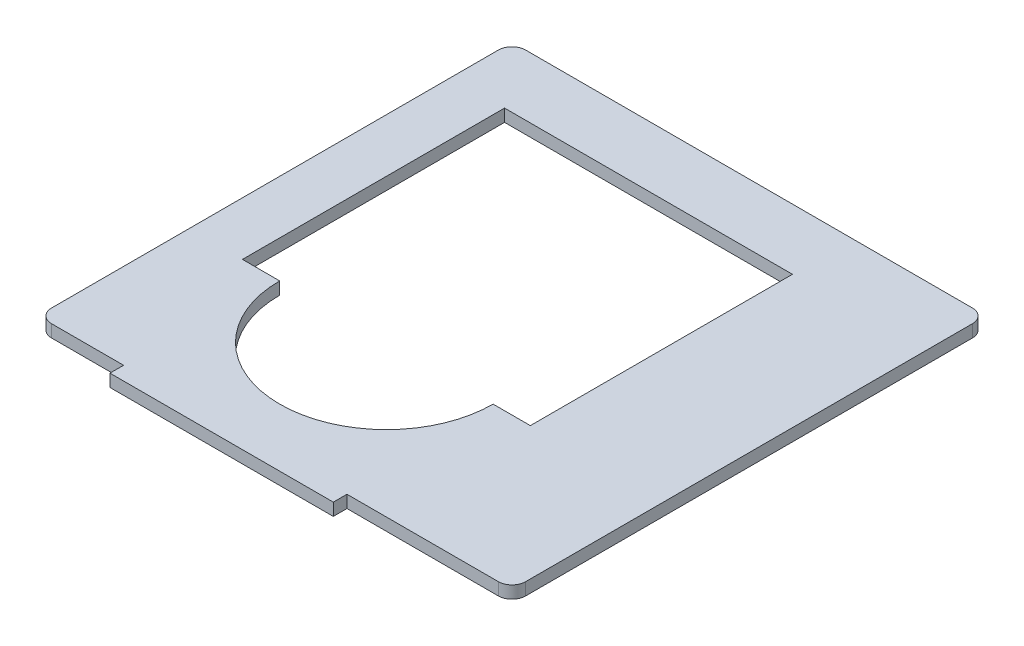
ISO-10303-21;
HEADER;
FILE_DESCRIPTION(('STEP AP214'),'2;1');
FILE_NAME('part.step','',(''),(''),'','','');
FILE_SCHEMA(('AUTOMOTIVE_DESIGN { 1 0 10303 214 1 1 1 1 }'));
ENDSEC;
DATA;
#1=APPLICATION_CONTEXT('core data for automotive mechanical design processes');
#2=APPLICATION_PROTOCOL_DEFINITION('international standard','automotive_design',2000,#1);
#3=PRODUCT_CONTEXT('',#1,'mechanical');
#4=PRODUCT('Part','Part','',(#3));
#5=PRODUCT_RELATED_PRODUCT_CATEGORY('part','',(#4));
#6=PRODUCT_DEFINITION_FORMATION('','',#4);
#7=PRODUCT_DEFINITION_CONTEXT('part definition',#1,'design');
#8=PRODUCT_DEFINITION('design','',#6,#7);
#9=PRODUCT_DEFINITION_SHAPE('','',#8);
#10=(LENGTH_UNIT() NAMED_UNIT(*) SI_UNIT(.MILLI.,.METRE.));
#11=(NAMED_UNIT(*) PLANE_ANGLE_UNIT() SI_UNIT($,.RADIAN.));
#12=(NAMED_UNIT(*) SI_UNIT($,.STERADIAN.) SOLID_ANGLE_UNIT());
#13=UNCERTAINTY_MEASURE_WITH_UNIT(LENGTH_MEASURE(1.E-05),#10,'distance_accuracy_value','');
#14=(GEOMETRIC_REPRESENTATION_CONTEXT(3) GLOBAL_UNCERTAINTY_ASSIGNED_CONTEXT((#13)) GLOBAL_UNIT_ASSIGNED_CONTEXT((#10,
#11,#12)) REPRESENTATION_CONTEXT('',''));
#15=CARTESIAN_POINT('',(0.,0.,0.));
#16=DIRECTION('',(0.,0.,1.));
#17=DIRECTION('',(1.,0.,0.));
#18=AXIS2_PLACEMENT_3D('',#15,#16,#17);
#19=CARTESIAN_POINT('',(90.,2.5,95.4999999999999));
#20=DIRECTION('',(0.,0.,-1.));
#21=DIRECTION('',(-1.,0.,0.));
#22=AXIS2_PLACEMENT_3D('',#19,#20,#21);
#23=PLANE('',#22);
#24=DIRECTION('',(1.,0.,0.));
#25=VECTOR('',#24,1.);
#26=CARTESIAN_POINT('',(90.,-2.5,95.4999999999999));
#27=LINE('',#26,#25);
#28=CARTESIAN_POINT('',(-90.,-2.5,95.5));
#29=VERTEX_POINT('',#28);
#30=CARTESIAN_POINT('',(-61.,-2.5,95.5));
#31=VERTEX_POINT('',#30);
#32=EDGE_CURVE('E271',#29,#31,#27,.T.);
#33=ORIENTED_EDGE('',*,*,#32,.T.);
#34=DIRECTION('',(0.,1.,0.));
#35=VECTOR('',#34,1.);
#36=CARTESIAN_POINT('',(-61.0000000000001,-2.5,95.5));
#37=LINE('',#36,#35);
#38=CARTESIAN_POINT('',(-61.,2.5,95.5));
#39=VERTEX_POINT('',#38);
#40=EDGE_CURVE('E61',#31,#39,#37,.T.);
#41=ORIENTED_EDGE('',*,*,#40,.T.);
#42=DIRECTION('',(1.,0.,0.));
#43=VECTOR('',#42,1.);
#44=CARTESIAN_POINT('',(90.,2.5,95.4999999999999));
#45=LINE('',#44,#43);
#46=CARTESIAN_POINT('',(-90.,2.5,95.5));
#47=VERTEX_POINT('',#46);
#48=EDGE_CURVE('E289',#47,#39,#45,.T.);
#49=ORIENTED_EDGE('',*,*,#48,.F.);
#50=DIRECTION('',(0.,-1.,0.));
#51=VECTOR('',#50,1.);
#52=CARTESIAN_POINT('',(-90.,2.5,95.5));
#53=LINE('',#52,#51);
#54=EDGE_CURVE('E320',#47,#29,#53,.T.);
#55=ORIENTED_EDGE('',*,*,#54,.T.);
#56=EDGE_LOOP('',(#33,#41,#49,#55));
#57=FACE_BOUND('',#56,.T.);
#58=ADVANCED_FACE('F37',(#57),#23,.F.);
#59=CARTESIAN_POINT('',(90.,2.5,89.9999999999999));
#60=DIRECTION('',(0.,-1.,0.));
#61=DIRECTION('',(0.,0.,-1.));
#62=AXIS2_PLACEMENT_3D('',#59,#60,#61);
#63=CYLINDRICAL_SURFACE('',#62,5.5);
#64=CARTESIAN_POINT('',(90.,-2.5,89.9999999999999));
#65=DIRECTION('',(0.,1.,0.));
#66=DIRECTION('',(0.,0.,-1.));
#67=AXIS2_PLACEMENT_3D('',#64,#65,#66);
#68=CIRCLE('',#67,5.5);
#69=CARTESIAN_POINT('',(90.,-2.5,95.4999999999999));
#70=VERTEX_POINT('',#69);
#71=CARTESIAN_POINT('',(95.5,-2.5,89.9999999999999));
#72=VERTEX_POINT('',#71);
#73=EDGE_CURVE('E250',#70,#72,#68,.T.);
#74=ORIENTED_EDGE('',*,*,#73,.T.);
#75=DIRECTION('',(0.,-1.,0.));
#76=VECTOR('',#75,1.);
#77=CARTESIAN_POINT('',(95.5,2.5,89.9999999999999));
#78=LINE('',#77,#76);
#79=CARTESIAN_POINT('',(95.5,2.5,89.9999999999999));
#80=VERTEX_POINT('',#79);
#81=EDGE_CURVE('E11',#80,#72,#78,.T.);
#82=ORIENTED_EDGE('',*,*,#81,.F.);
#83=CARTESIAN_POINT('',(90.,2.5,89.9999999999999));
#84=DIRECTION('',(0.,1.,0.));
#85=DIRECTION('',(0.,0.,-1.));
#86=AXIS2_PLACEMENT_3D('',#83,#84,#85);
#87=CIRCLE('',#86,5.5);
#88=CARTESIAN_POINT('',(90.,2.5,95.4999999999999));
#89=VERTEX_POINT('',#88);
#90=EDGE_CURVE('E266',#89,#80,#87,.T.);
#91=ORIENTED_EDGE('',*,*,#90,.F.);
#92=DIRECTION('',(0.,-1.,0.));
#93=VECTOR('',#92,1.);
#94=CARTESIAN_POINT('',(90.,2.5,95.4999999999999));
#95=LINE('',#94,#93);
#96=EDGE_CURVE('E292',#89,#70,#95,.T.);
#97=ORIENTED_EDGE('',*,*,#96,.T.);
#98=EDGE_LOOP('',(#74,#82,#91,#97));
#99=FACE_BOUND('',#98,.T.);
#100=ADVANCED_FACE('F39',(#99),#63,.T.);
#101=CARTESIAN_POINT('',(95.5,2.5,-90.0000000000001));
#102=DIRECTION('',(-1.,0.,0.));
#103=DIRECTION('',(0.,0.,1.));
#104=AXIS2_PLACEMENT_3D('',#101,#102,#103);
#105=PLANE('',#104);
#106=DIRECTION('',(0.,0.,-1.));
#107=VECTOR('',#106,1.);
#108=CARTESIAN_POINT('',(95.5,-2.5,-90.0000000000001));
#109=LINE('',#108,#107);
#110=CARTESIAN_POINT('',(95.5,-2.5,-90.0000000000001));
#111=VERTEX_POINT('',#110);
#112=EDGE_CURVE('E296',#72,#111,#109,.T.);
#113=ORIENTED_EDGE('',*,*,#112,.T.);
#114=DIRECTION('',(0.,-1.,0.));
#115=VECTOR('',#114,1.);
#116=CARTESIAN_POINT('',(95.5,2.5,-90.0000000000001));
#117=LINE('',#116,#115);
#118=CARTESIAN_POINT('',(95.5,2.5,-90.0000000000001));
#119=VERTEX_POINT('',#118);
#120=EDGE_CURVE('E46',#119,#111,#117,.T.);
#121=ORIENTED_EDGE('',*,*,#120,.F.);
#122=DIRECTION('',(0.,0.,-1.));
#123=VECTOR('',#122,1.);
#124=CARTESIAN_POINT('',(95.5,2.5,-90.0000000000001));
#125=LINE('',#124,#123);
#126=EDGE_CURVE('E270',#80,#119,#125,.T.);
#127=ORIENTED_EDGE('',*,*,#126,.F.);
#128=ORIENTED_EDGE('',*,*,#81,.T.);
#129=EDGE_LOOP('',(#113,#121,#127,#128));
#130=FACE_BOUND('',#129,.T.);
#131=ADVANCED_FACE('F365',(#130),#105,.F.);
#132=CARTESIAN_POINT('',(90.,2.5,-90.0000000000001));
#133=DIRECTION('',(0.,-1.,0.));
#134=DIRECTION('',(0.,0.,-1.));
#135=AXIS2_PLACEMENT_3D('',#132,#133,#134);
#136=CYLINDRICAL_SURFACE('',#135,5.50000000000002);
#137=CARTESIAN_POINT('',(90.,-2.5,-90.0000000000001));
#138=DIRECTION('',(0.,1.,0.));
#139=DIRECTION('',(0.,0.,-1.));
#140=AXIS2_PLACEMENT_3D('',#137,#138,#139);
#141=CIRCLE('',#140,5.50000000000002);
#142=CARTESIAN_POINT('',(90.,-2.5,-95.5000000000001));
#143=VERTEX_POINT('',#142);
#144=EDGE_CURVE('E299',#111,#143,#141,.T.);
#145=ORIENTED_EDGE('',*,*,#144,.T.);
#146=DIRECTION('',(0.,-1.,0.));
#147=VECTOR('',#146,1.);
#148=CARTESIAN_POINT('',(90.,2.5,-95.5000000000001));
#149=LINE('',#148,#147);
#150=CARTESIAN_POINT('',(90.,2.5,-95.5000000000001));
#151=VERTEX_POINT('',#150);
#152=EDGE_CURVE('E336',#151,#143,#149,.T.);
#153=ORIENTED_EDGE('',*,*,#152,.F.);
#154=CARTESIAN_POINT('',(90.,2.5,-90.0000000000001));
#155=DIRECTION('',(0.,1.,0.));
#156=DIRECTION('',(0.,0.,-1.));
#157=AXIS2_PLACEMENT_3D('',#154,#155,#156);
#158=CIRCLE('',#157,5.50000000000002);
#159=EDGE_CURVE('E274',#119,#151,#158,.T.);
#160=ORIENTED_EDGE('',*,*,#159,.F.);
#161=ORIENTED_EDGE('',*,*,#120,.T.);
#162=EDGE_LOOP('',(#145,#153,#160,#161));
#163=FACE_BOUND('',#162,.T.);
#164=ADVANCED_FACE('F345',(#163),#136,.T.);
#165=CARTESIAN_POINT('',(90.,2.5,-95.5000000000001));
#166=DIRECTION('',(0.,0.,1.));
#167=DIRECTION('',(1.,0.,0.));
#168=AXIS2_PLACEMENT_3D('',#165,#166,#167);
#169=PLANE('',#168);
#170=DIRECTION('',(-1.,0.,0.));
#171=VECTOR('',#170,1.);
#172=CARTESIAN_POINT('',(90.,-2.5,-95.5000000000001));
#173=LINE('',#172,#171);
#174=CARTESIAN_POINT('',(-90.,-2.5,-95.5));
#175=VERTEX_POINT('',#174);
#176=EDGE_CURVE('E302',#143,#175,#173,.T.);
#177=ORIENTED_EDGE('',*,*,#176,.T.);
#178=DIRECTION('',(0.,-1.,0.));
#179=VECTOR('',#178,1.);
#180=CARTESIAN_POINT('',(-90.,2.5,-95.5));
#181=LINE('',#180,#179);
#182=CARTESIAN_POINT('',(-90.,2.5,-95.5));
#183=VERTEX_POINT('',#182);
#184=EDGE_CURVE('E332',#183,#175,#181,.T.);
#185=ORIENTED_EDGE('',*,*,#184,.F.);
#186=DIRECTION('',(-1.,0.,0.));
#187=VECTOR('',#186,1.);
#188=CARTESIAN_POINT('',(90.,2.5,-95.5000000000001));
#189=LINE('',#188,#187);
#190=EDGE_CURVE('E277',#151,#183,#189,.T.);
#191=ORIENTED_EDGE('',*,*,#190,.F.);
#192=ORIENTED_EDGE('',*,*,#152,.T.);
#193=EDGE_LOOP('',(#177,#185,#191,#192));
#194=FACE_BOUND('',#193,.T.);
#195=ADVANCED_FACE('F353',(#194),#169,.F.);
#196=CARTESIAN_POINT('',(-90.,2.5,-90.));
#197=DIRECTION('',(0.,-1.,0.));
#198=DIRECTION('',(0.,0.,-1.));
#199=AXIS2_PLACEMENT_3D('',#196,#197,#198);
#200=CYLINDRICAL_SURFACE('',#199,5.5);
#201=CARTESIAN_POINT('',(-90.,-2.5,-90.));
#202=DIRECTION('',(0.,1.,0.));
#203=DIRECTION('',(0.,0.,1.));
#204=AXIS2_PLACEMENT_3D('',#201,#202,#203);
#205=CIRCLE('',#204,5.5);
#206=CARTESIAN_POINT('',(-95.5,-2.5,-90.));
#207=VERTEX_POINT('',#206);
#208=EDGE_CURVE('E305',#175,#207,#205,.T.);
#209=ORIENTED_EDGE('',*,*,#208,.T.);
#210=DIRECTION('',(0.,-1.,0.));
#211=VECTOR('',#210,1.);
#212=CARTESIAN_POINT('',(-95.5,2.5,-90.));
#213=LINE('',#212,#211);
#214=CARTESIAN_POINT('',(-95.5,2.5,-90.));
#215=VERTEX_POINT('',#214);
#216=EDGE_CURVE('E328',#215,#207,#213,.T.);
#217=ORIENTED_EDGE('',*,*,#216,.F.);
#218=CARTESIAN_POINT('',(-90.,2.5,-90.));
#219=DIRECTION('',(0.,1.,0.));
#220=DIRECTION('',(0.,0.,1.));
#221=AXIS2_PLACEMENT_3D('',#218,#219,#220);
#222=CIRCLE('',#221,5.5);
#223=EDGE_CURVE('E280',#183,#215,#222,.T.);
#224=ORIENTED_EDGE('',*,*,#223,.F.);
#225=ORIENTED_EDGE('',*,*,#184,.T.);
#226=EDGE_LOOP('',(#209,#217,#224,#225));
#227=FACE_BOUND('',#226,.T.);
#228=ADVANCED_FACE('F357',(#227),#200,.T.);
#229=CARTESIAN_POINT('',(-95.5,2.5,-90.));
#230=DIRECTION('',(1.,0.,0.));
#231=DIRECTION('',(0.,0.,-1.));
#232=AXIS2_PLACEMENT_3D('',#229,#230,#231);
#233=PLANE('',#232);
#234=DIRECTION('',(0.,0.,1.));
#235=VECTOR('',#234,1.);
#236=CARTESIAN_POINT('',(-95.5,-2.5,-90.));
#237=LINE('',#236,#235);
#238=CARTESIAN_POINT('',(-95.5,-2.5,90.));
#239=VERTEX_POINT('',#238);
#240=EDGE_CURVE('E308',#207,#239,#237,.T.);
#241=ORIENTED_EDGE('',*,*,#240,.T.);
#242=DIRECTION('',(0.,-1.,0.));
#243=VECTOR('',#242,1.);
#244=CARTESIAN_POINT('',(-95.5,2.5,90.));
#245=LINE('',#244,#243);
#246=CARTESIAN_POINT('',(-95.5,2.5,90.));
#247=VERTEX_POINT('',#246);
#248=EDGE_CURVE('E324',#247,#239,#245,.T.);
#249=ORIENTED_EDGE('',*,*,#248,.F.);
#250=DIRECTION('',(0.,0.,1.));
#251=VECTOR('',#250,1.);
#252=CARTESIAN_POINT('',(-95.5,2.5,-90.));
#253=LINE('',#252,#251);
#254=EDGE_CURVE('E283',#215,#247,#253,.T.);
#255=ORIENTED_EDGE('',*,*,#254,.F.);
#256=ORIENTED_EDGE('',*,*,#216,.T.);
#257=EDGE_LOOP('',(#241,#249,#255,#256));
#258=FACE_BOUND('',#257,.T.);
#259=ADVANCED_FACE('F378',(#258),#233,.F.);
#260=CARTESIAN_POINT('',(-90.,2.5,90.));
#261=DIRECTION('',(0.,-1.,0.));
#262=DIRECTION('',(0.,0.,-1.));
#263=AXIS2_PLACEMENT_3D('',#260,#261,#262);
#264=CYLINDRICAL_SURFACE('',#263,5.5);
#265=CARTESIAN_POINT('',(-90.,-2.5,90.));
#266=DIRECTION('',(0.,1.,0.));
#267=DIRECTION('',(0.,0.,-1.));
#268=AXIS2_PLACEMENT_3D('',#265,#266,#267);
#269=CIRCLE('',#268,5.5);
#270=EDGE_CURVE('E311',#239,#29,#269,.T.);
#271=ORIENTED_EDGE('',*,*,#270,.T.);
#272=ORIENTED_EDGE('',*,*,#54,.F.);
#273=CARTESIAN_POINT('',(-90.,2.5,90.));
#274=DIRECTION('',(0.,1.,0.));
#275=DIRECTION('',(0.,0.,-1.));
#276=AXIS2_PLACEMENT_3D('',#273,#274,#275);
#277=CIRCLE('',#276,5.5);
#278=EDGE_CURVE('E286',#247,#47,#277,.T.);
#279=ORIENTED_EDGE('',*,*,#278,.F.);
#280=ORIENTED_EDGE('',*,*,#248,.T.);
#281=EDGE_LOOP('',(#271,#272,#279,#280));
#282=FACE_BOUND('',#281,.T.);
#283=ADVANCED_FACE('F376',(#282),#264,.T.);
#284=CARTESIAN_POINT('',(28.9999999999999,2.5,95.5));
#285=VERTEX_POINT('',#284);
#286=EDGE_CURVE('E53',#285,#89,#45,.T.);
#287=ORIENTED_EDGE('',*,*,#286,.F.);
#288=DIRECTION('',(0.,1.,0.));
#289=VECTOR('',#288,1.);
#290=CARTESIAN_POINT('',(28.9999999999999,-2.5,95.5));
#291=LINE('',#290,#289);
#292=CARTESIAN_POINT('',(28.9999999999999,-2.5,95.5));
#293=VERTEX_POINT('',#292);
#294=EDGE_CURVE('E199',#293,#285,#291,.T.);
#295=ORIENTED_EDGE('',*,*,#294,.F.);
#296=EDGE_CURVE('E314',#293,#70,#27,.T.);
#297=ORIENTED_EDGE('',*,*,#296,.T.);
#298=ORIENTED_EDGE('',*,*,#96,.F.);
#299=EDGE_LOOP('',(#287,#295,#297,#298));
#300=FACE_BOUND('',#299,.T.);
#301=ADVANCED_FACE('F368',(#300),#23,.F.);
#302=CARTESIAN_POINT('',(90.,2.5,89.9999999999999));
#303=DIRECTION('',(0.,-1.,0.));
#304=DIRECTION('',(0.,0.,-1.));
#305=AXIS2_PLACEMENT_3D('',#302,#303,#304);
#306=PLANE('',#305);
#307=DIRECTION('',(0.,0.,1.));
#308=VECTOR('',#307,1.);
#309=CARTESIAN_POINT('',(-74.0000000000026,2.5,-70.999999999998));
#310=LINE('',#309,#308);
#311=CARTESIAN_POINT('',(-74.0000000000025,2.5,-70.999999999998));
#312=VERTEX_POINT('',#311);
#313=CARTESIAN_POINT('',(-74.0000000000025,2.5,34.6102296711069));
#314=VERTEX_POINT('',#313);
#315=EDGE_CURVE('E228',#312,#314,#310,.T.);
#316=ORIENTED_EDGE('',*,*,#315,.F.);
#317=DIRECTION('',(-1.,0.,0.));
#318=VECTOR('',#317,1.);
#319=CARTESIAN_POINT('',(41.9999999999974,2.5,-70.999999999998));
#320=LINE('',#319,#318);
#321=CARTESIAN_POINT('',(41.9999999999974,2.5,-70.999999999998));
#322=VERTEX_POINT('',#321);
#323=EDGE_CURVE('E198',#322,#312,#320,.T.);
#324=ORIENTED_EDGE('',*,*,#323,.F.);
#325=DIRECTION('',(0.,0.,1.));
#326=VECTOR('',#325,1.);
#327=CARTESIAN_POINT('',(41.9999999999974,2.5,-70.999999999998));
#328=LINE('',#327,#326);
#329=CARTESIAN_POINT('',(41.9999999999974,2.5,34.6102296711068));
#330=VERTEX_POINT('',#329);
#331=EDGE_CURVE('E207',#322,#330,#328,.T.);
#332=ORIENTED_EDGE('',*,*,#331,.T.);
#333=DIRECTION('',(1.,0.,0.));
#334=VECTOR('',#333,1.);
#335=CARTESIAN_POINT('',(26.9999999999974,2.5,34.6102296711068));
#336=LINE('',#335,#334);
#337=CARTESIAN_POINT('',(26.9999999999974,2.5,34.6102296711068));
#338=VERTEX_POINT('',#337);
#339=EDGE_CURVE('E240',#338,#330,#336,.T.);
#340=ORIENTED_EDGE('',*,*,#339,.F.);
#341=CARTESIAN_POINT('',(-16.0000000000026,2.5,34.6102296711069));
#342=DIRECTION('',(0.,-1.,0.));
#343=DIRECTION('',(0.,0.,-1.));
#344=AXIS2_PLACEMENT_3D('',#341,#342,#343);
#345=CIRCLE('',#344,43.);
#346=CARTESIAN_POINT('',(-59.0000000000026,2.5,34.6102296711069));
#347=VERTEX_POINT('',#346);
#348=EDGE_CURVE('E236',#338,#347,#345,.T.);
#349=ORIENTED_EDGE('',*,*,#348,.T.);
#350=DIRECTION('',(-1.,0.,0.));
#351=VECTOR('',#350,1.);
#352=CARTESIAN_POINT('',(-59.0000000000026,2.5,34.6102296711069));
#353=LINE('',#352,#351);
#354=EDGE_CURVE('E232',#347,#314,#353,.T.);
#355=ORIENTED_EDGE('',*,*,#354,.T.);
#356=EDGE_LOOP('',(#316,#324,#332,#340,#349,#355));
#357=FACE_BOUND('',#356,.T.);
#358=ORIENTED_EDGE('',*,*,#90,.T.);
#359=ORIENTED_EDGE('',*,*,#126,.T.);
#360=ORIENTED_EDGE('',*,*,#159,.T.);
#361=ORIENTED_EDGE('',*,*,#190,.T.);
#362=ORIENTED_EDGE('',*,*,#223,.T.);
#363=ORIENTED_EDGE('',*,*,#254,.T.);
#364=ORIENTED_EDGE('',*,*,#278,.T.);
#365=ORIENTED_EDGE('',*,*,#48,.T.);
#366=DIRECTION('',(0.,0.,1.));
#367=VECTOR('',#366,1.);
#368=CARTESIAN_POINT('',(-61.0000000000001,2.5,101.000000000002));
#369=LINE('',#368,#367);
#370=CARTESIAN_POINT('',(-61.0000000000001,2.5,101.000000000002));
#371=VERTEX_POINT('',#370);
#372=EDGE_CURVE('E194',#39,#371,#369,.T.);
#373=ORIENTED_EDGE('',*,*,#372,.T.);
#374=DIRECTION('',(1.,0.,0.));
#375=VECTOR('',#374,1.);
#376=CARTESIAN_POINT('',(-61.0000000000001,2.5,101.000000000002));
#377=LINE('',#376,#375);
#378=CARTESIAN_POINT('',(28.9999999999999,2.5,101.000000000002));
#379=VERTEX_POINT('',#378);
#380=EDGE_CURVE('E170',#371,#379,#377,.T.);
#381=ORIENTED_EDGE('',*,*,#380,.T.);
#382=DIRECTION('',(0.,0.,-1.));
#383=VECTOR('',#382,1.);
#384=CARTESIAN_POINT('',(28.9999999999999,2.5,101.000000000002));
#385=LINE('',#384,#383);
#386=EDGE_CURVE('E188',#379,#285,#385,.T.);
#387=ORIENTED_EDGE('',*,*,#386,.T.);
#388=ORIENTED_EDGE('',*,*,#286,.T.);
#389=EDGE_LOOP('',(#358,#359,#360,#361,#362,#363,#364,#365,#373,#381,#387,#388));
#390=FACE_BOUND('',#389,.T.);
#391=ADVANCED_FACE('F361',(#357,#390),#306,.F.);
#392=CARTESIAN_POINT('',(90.,-2.5,89.9999999999999));
#393=DIRECTION('',(0.,-1.,0.));
#394=DIRECTION('',(0.,0.,-1.));
#395=AXIS2_PLACEMENT_3D('',#392,#393,#394);
#396=PLANE('',#395);
#397=DIRECTION('',(-1.,0.,0.));
#398=VECTOR('',#397,1.);
#399=CARTESIAN_POINT('',(41.9999999999974,-2.5,-70.999999999998));
#400=LINE('',#399,#398);
#401=CARTESIAN_POINT('',(41.9999999999974,-2.5,-70.999999999998));
#402=VERTEX_POINT('',#401);
#403=CARTESIAN_POINT('',(-74.0000000000026,-2.5,-70.999999999998));
#404=VERTEX_POINT('',#403);
#405=EDGE_CURVE('E202',#402,#404,#400,.T.);
#406=ORIENTED_EDGE('',*,*,#405,.T.);
#407=DIRECTION('',(0.,0.,1.));
#408=VECTOR('',#407,1.);
#409=CARTESIAN_POINT('',(-74.0000000000026,-2.5,-70.999999999998));
#410=LINE('',#409,#408);
#411=CARTESIAN_POINT('',(-74.0000000000025,-2.5,34.6102296711069));
#412=VERTEX_POINT('',#411);
#413=EDGE_CURVE('E206',#404,#412,#410,.T.);
#414=ORIENTED_EDGE('',*,*,#413,.T.);
#415=DIRECTION('',(-1.,0.,0.));
#416=VECTOR('',#415,1.);
#417=CARTESIAN_POINT('',(-59.0000000000026,-2.5,34.6102296711069));
#418=LINE('',#417,#416);
#419=CARTESIAN_POINT('',(-59.0000000000026,-2.5,34.6102296711069));
#420=VERTEX_POINT('',#419);
#421=EDGE_CURVE('E211',#420,#412,#418,.T.);
#422=ORIENTED_EDGE('',*,*,#421,.F.);
#423=CARTESIAN_POINT('',(-16.0000000000026,-2.5,34.6102296711069));
#424=DIRECTION('',(0.,-1.,0.));
#425=DIRECTION('',(0.,0.,-1.));
#426=AXIS2_PLACEMENT_3D('',#423,#424,#425);
#427=CIRCLE('',#426,43.);
#428=CARTESIAN_POINT('',(26.9999999999974,-2.5,34.6102296711068));
#429=VERTEX_POINT('',#428);
#430=EDGE_CURVE('E215',#429,#420,#427,.T.);
#431=ORIENTED_EDGE('',*,*,#430,.F.);
#432=DIRECTION('',(1.,0.,0.));
#433=VECTOR('',#432,1.);
#434=CARTESIAN_POINT('',(26.9999999999974,-2.5,34.6102296711068));
#435=LINE('',#434,#433);
#436=CARTESIAN_POINT('',(41.9999999999974,-2.5,34.6102296711068));
#437=VERTEX_POINT('',#436);
#438=EDGE_CURVE('E218',#429,#437,#435,.T.);
#439=ORIENTED_EDGE('',*,*,#438,.T.);
#440=DIRECTION('',(0.,0.,1.));
#441=VECTOR('',#440,1.);
#442=CARTESIAN_POINT('',(41.9999999999974,-2.5,-70.999999999998));
#443=LINE('',#442,#441);
#444=EDGE_CURVE('E222',#402,#437,#443,.T.);
#445=ORIENTED_EDGE('',*,*,#444,.F.);
#446=EDGE_LOOP('',(#406,#414,#422,#431,#439,#445));
#447=FACE_BOUND('',#446,.T.);
#448=ORIENTED_EDGE('',*,*,#73,.F.);
#449=ORIENTED_EDGE('',*,*,#296,.F.);
#450=DIRECTION('',(0.,0.,-1.));
#451=VECTOR('',#450,1.);
#452=CARTESIAN_POINT('',(28.9999999999999,-2.5,101.000000000002));
#453=LINE('',#452,#451);
#454=CARTESIAN_POINT('',(28.9999999999999,-2.5,101.000000000002));
#455=VERTEX_POINT('',#454);
#456=EDGE_CURVE('E176',#455,#293,#453,.T.);
#457=ORIENTED_EDGE('',*,*,#456,.F.);
#458=DIRECTION('',(1.,0.,0.));
#459=VECTOR('',#458,1.);
#460=CARTESIAN_POINT('',(-61.0000000000001,-2.5,101.000000000002));
#461=LINE('',#460,#459);
#462=CARTESIAN_POINT('',(-61.0000000000001,-2.5,101.000000000002));
#463=VERTEX_POINT('',#462);
#464=EDGE_CURVE('E168',#463,#455,#461,.T.);
#465=ORIENTED_EDGE('',*,*,#464,.F.);
#466=DIRECTION('',(0.,0.,1.));
#467=VECTOR('',#466,1.);
#468=CARTESIAN_POINT('',(-61.0000000000001,-2.5,101.000000000002));
#469=LINE('',#468,#467);
#470=EDGE_CURVE('E184',#31,#463,#469,.T.);
#471=ORIENTED_EDGE('',*,*,#470,.F.);
#472=ORIENTED_EDGE('',*,*,#32,.F.);
#473=ORIENTED_EDGE('',*,*,#270,.F.);
#474=ORIENTED_EDGE('',*,*,#240,.F.);
#475=ORIENTED_EDGE('',*,*,#208,.F.);
#476=ORIENTED_EDGE('',*,*,#176,.F.);
#477=ORIENTED_EDGE('',*,*,#144,.F.);
#478=ORIENTED_EDGE('',*,*,#112,.F.);
#479=EDGE_LOOP('',(#448,#449,#457,#465,#471,#472,#473,#474,#475,#476,#477,#478));
#480=FACE_BOUND('',#479,.T.);
#481=ADVANCED_FACE('F182',(#447,#480),#396,.T.);
#482=CARTESIAN_POINT('',(41.9999999999974,-2.5,-70.999999999998));
#483=DIRECTION('',(0.,0.,-1.));
#484=DIRECTION('',(-1.,0.,0.));
#485=AXIS2_PLACEMENT_3D('',#482,#483,#484);
#486=PLANE('',#485);
#487=ORIENTED_EDGE('',*,*,#323,.T.);
#488=DIRECTION('',(0.,1.,0.));
#489=VECTOR('',#488,1.);
#490=CARTESIAN_POINT('',(-74.0000000000026,-2.5,-70.999999999998));
#491=LINE('',#490,#489);
#492=EDGE_CURVE('E225',#404,#312,#491,.T.);
#493=ORIENTED_EDGE('',*,*,#492,.F.);
#494=ORIENTED_EDGE('',*,*,#405,.F.);
#495=DIRECTION('',(0.,1.,0.));
#496=VECTOR('',#495,1.);
#497=CARTESIAN_POINT('',(41.9999999999974,-2.5,-70.999999999998));
#498=LINE('',#497,#496);
#499=EDGE_CURVE('E247',#402,#322,#498,.T.);
#500=ORIENTED_EDGE('',*,*,#499,.T.);
#501=EDGE_LOOP('',(#487,#493,#494,#500));
#502=FACE_BOUND('',#501,.T.);
#503=ADVANCED_FACE('F404',(#502),#486,.F.);
#504=CARTESIAN_POINT('',(41.9999999999974,-2.5,-70.999999999998));
#505=DIRECTION('',(-1.,0.,0.));
#506=DIRECTION('',(0.,0.,1.));
#507=AXIS2_PLACEMENT_3D('',#504,#505,#506);
#508=PLANE('',#507);
#509=ORIENTED_EDGE('',*,*,#331,.F.);
#510=ORIENTED_EDGE('',*,*,#499,.F.);
#511=ORIENTED_EDGE('',*,*,#444,.T.);
#512=DIRECTION('',(0.,1.,0.));
#513=VECTOR('',#512,1.);
#514=CARTESIAN_POINT('',(41.9999999999974,-2.5,34.6102296711068));
#515=LINE('',#514,#513);
#516=EDGE_CURVE('E251',#437,#330,#515,.T.);
#517=ORIENTED_EDGE('',*,*,#516,.T.);
#518=EDGE_LOOP('',(#509,#510,#511,#517));
#519=FACE_BOUND('',#518,.T.);
#520=ADVANCED_FACE('F410',(#519),#508,.T.);
#521=CARTESIAN_POINT('',(26.9999999999974,-2.5,34.6102296711068));
#522=DIRECTION('',(0.,0.,1.));
#523=DIRECTION('',(1.,0.,0.));
#524=AXIS2_PLACEMENT_3D('',#521,#522,#523);
#525=PLANE('',#524);
#526=ORIENTED_EDGE('',*,*,#339,.T.);
#527=ORIENTED_EDGE('',*,*,#516,.F.);
#528=ORIENTED_EDGE('',*,*,#438,.F.);
#529=DIRECTION('',(0.,1.,0.));
#530=VECTOR('',#529,1.);
#531=CARTESIAN_POINT('',(26.9999999999974,-2.5,34.6102296711068));
#532=LINE('',#531,#530);
#533=EDGE_CURVE('E254',#429,#338,#532,.T.);
#534=ORIENTED_EDGE('',*,*,#533,.T.);
#535=EDGE_LOOP('',(#526,#527,#528,#534));
#536=FACE_BOUND('',#535,.T.);
#537=ADVANCED_FACE('F423',(#536),#525,.F.);
#538=CARTESIAN_POINT('',(-16.0000000000026,-2.5,34.6102296711069));
#539=DIRECTION('',(0.,1.,0.));
#540=DIRECTION('',(0.,0.,1.));
#541=AXIS2_PLACEMENT_3D('',#538,#539,#540);
#542=CYLINDRICAL_SURFACE('',#541,43.);
#543=ORIENTED_EDGE('',*,*,#348,.F.);
#544=ORIENTED_EDGE('',*,*,#533,.F.);
#545=ORIENTED_EDGE('',*,*,#430,.T.);
#546=DIRECTION('',(0.,1.,0.));
#547=VECTOR('',#546,1.);
#548=CARTESIAN_POINT('',(-59.0000000000026,-2.5,34.6102296711069));
#549=LINE('',#548,#547);
#550=EDGE_CURVE('E257',#420,#347,#549,.T.);
#551=ORIENTED_EDGE('',*,*,#550,.T.);
#552=EDGE_LOOP('',(#543,#544,#545,#551));
#553=FACE_BOUND('',#552,.T.);
#554=ADVANCED_FACE('F419',(#553),#542,.F.);
#555=CARTESIAN_POINT('',(-59.0000000000026,-2.5,34.6102296711069));
#556=DIRECTION('',(0.,0.,-1.));
#557=DIRECTION('',(-1.,0.,0.));
#558=AXIS2_PLACEMENT_3D('',#555,#556,#557);
#559=PLANE('',#558);
#560=ORIENTED_EDGE('',*,*,#354,.F.);
#561=ORIENTED_EDGE('',*,*,#550,.F.);
#562=ORIENTED_EDGE('',*,*,#421,.T.);
#563=DIRECTION('',(0.,1.,0.));
#564=VECTOR('',#563,1.);
#565=CARTESIAN_POINT('',(-74.0000000000025,-2.5,34.6102296711069));
#566=LINE('',#565,#564);
#567=EDGE_CURVE('E260',#412,#314,#566,.T.);
#568=ORIENTED_EDGE('',*,*,#567,.T.);
#569=EDGE_LOOP('',(#560,#561,#562,#568));
#570=FACE_BOUND('',#569,.T.);
#571=ADVANCED_FACE('F415',(#570),#559,.T.);
#572=CARTESIAN_POINT('',(-74.0000000000026,-2.5,-70.999999999998));
#573=DIRECTION('',(-1.,0.,0.));
#574=DIRECTION('',(0.,0.,1.));
#575=AXIS2_PLACEMENT_3D('',#572,#573,#574);
#576=PLANE('',#575);
#577=ORIENTED_EDGE('',*,*,#315,.T.);
#578=ORIENTED_EDGE('',*,*,#567,.F.);
#579=ORIENTED_EDGE('',*,*,#413,.F.);
#580=ORIENTED_EDGE('',*,*,#492,.T.);
#581=EDGE_LOOP('',(#577,#578,#579,#580));
#582=FACE_BOUND('',#581,.T.);
#583=ADVANCED_FACE('F412',(#582),#576,.F.);
#584=CARTESIAN_POINT('',(-61.0000000000001,-2.5,101.000000000002));
#585=DIRECTION('',(-1.,0.,0.));
#586=DIRECTION('',(0.,0.,1.));
#587=AXIS2_PLACEMENT_3D('',#584,#585,#586);
#588=PLANE('',#587);
#589=ORIENTED_EDGE('',*,*,#372,.F.);
#590=ORIENTED_EDGE('',*,*,#40,.F.);
#591=ORIENTED_EDGE('',*,*,#470,.T.);
#592=DIRECTION('',(0.,1.,0.));
#593=VECTOR('',#592,1.);
#594=CARTESIAN_POINT('',(-61.0000000000001,-2.5,101.000000000002));
#595=LINE('',#594,#593);
#596=EDGE_CURVE('E165',#463,#371,#595,.T.);
#597=ORIENTED_EDGE('',*,*,#596,.T.);
#598=EDGE_LOOP('',(#589,#590,#591,#597));
#599=FACE_BOUND('',#598,.T.);
#600=ADVANCED_FACE('F187',(#599),#588,.T.);
#601=CARTESIAN_POINT('',(28.9999999999999,-2.5,101.000000000002));
#602=DIRECTION('',(1.,0.,0.));
#603=DIRECTION('',(0.,0.,-1.));
#604=AXIS2_PLACEMENT_3D('',#601,#602,#603);
#605=PLANE('',#604);
#606=ORIENTED_EDGE('',*,*,#386,.F.);
#607=DIRECTION('',(0.,1.,0.));
#608=VECTOR('',#607,1.);
#609=CARTESIAN_POINT('',(28.9999999999999,-2.5,101.000000000002));
#610=LINE('',#609,#608);
#611=EDGE_CURVE('E175',#455,#379,#610,.T.);
#612=ORIENTED_EDGE('',*,*,#611,.F.);
#613=ORIENTED_EDGE('',*,*,#456,.T.);
#614=ORIENTED_EDGE('',*,*,#294,.T.);
#615=EDGE_LOOP('',(#606,#612,#613,#614));
#616=FACE_BOUND('',#615,.T.);
#617=ADVANCED_FACE('F371',(#616),#605,.T.);
#618=CARTESIAN_POINT('',(-61.0000000000001,-2.5,101.000000000002));
#619=DIRECTION('',(0.,0.,1.));
#620=DIRECTION('',(1.,0.,0.));
#621=AXIS2_PLACEMENT_3D('',#618,#619,#620);
#622=PLANE('',#621);
#623=ORIENTED_EDGE('',*,*,#380,.F.);
#624=ORIENTED_EDGE('',*,*,#596,.F.);
#625=ORIENTED_EDGE('',*,*,#464,.T.);
#626=ORIENTED_EDGE('',*,*,#611,.T.);
#627=EDGE_LOOP('',(#623,#624,#625,#626));
#628=FACE_BOUND('',#627,.T.);
#629=ADVANCED_FACE('F167',(#628),#622,.T.);
#630=CLOSED_SHELL('',(#58,#100,#131,#164,#195,#228,#259,#283,#301,#391,#481,#503,#520,#537,#554,
#571,#583,#600,#617,#629));
#631=MANIFOLD_SOLID_BREP('B2',#630);
#632=ADVANCED_BREP_SHAPE_REPRESENTATION('',(#18,#631),#14);
#633=SHAPE_DEFINITION_REPRESENTATION(#9,#632);
ENDSEC;
END-ISO-10303-21;
